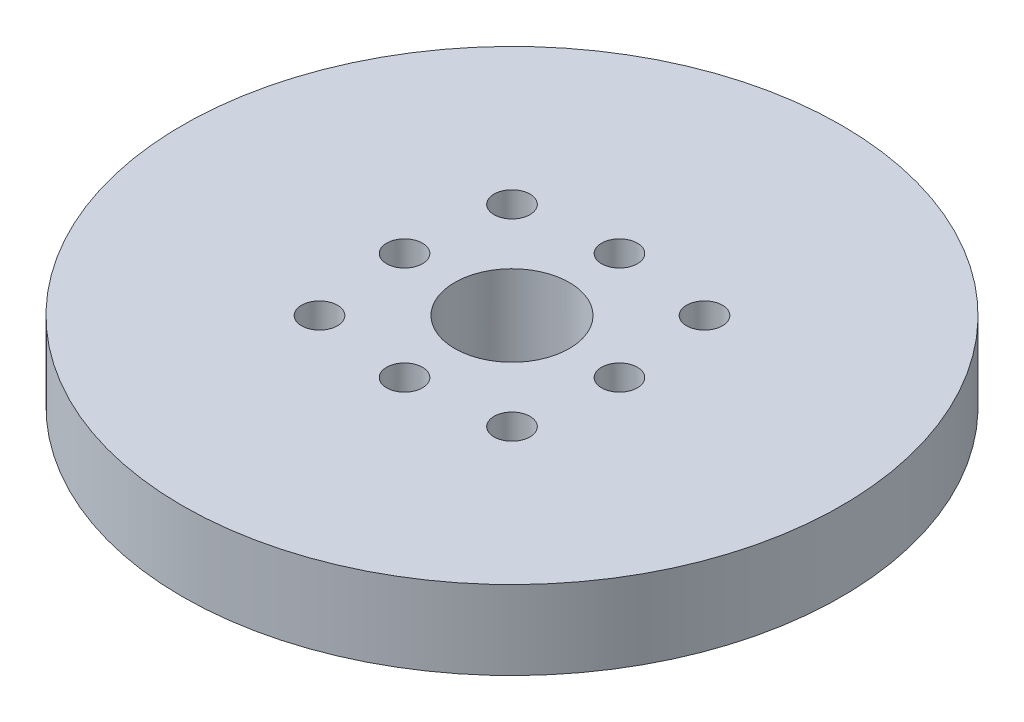
ISO-10303-21;
HEADER;
FILE_DESCRIPTION(('STEP AP214'),'2;1');
FILE_NAME('part.step','',(''),(''),'','','');
FILE_SCHEMA(('AUTOMOTIVE_DESIGN { 1 0 10303 214 1 1 1 1 }'));
ENDSEC;
DATA;
#1=APPLICATION_CONTEXT('core data for automotive mechanical design processes');
#2=APPLICATION_PROTOCOL_DEFINITION('international standard','automotive_design',2000,#1);
#3=PRODUCT_CONTEXT('',#1,'mechanical');
#4=PRODUCT('Part','Part','',(#3));
#5=PRODUCT_RELATED_PRODUCT_CATEGORY('part','',(#4));
#6=PRODUCT_DEFINITION_FORMATION('','',#4);
#7=PRODUCT_DEFINITION_CONTEXT('part definition',#1,'design');
#8=PRODUCT_DEFINITION('design','',#6,#7);
#9=PRODUCT_DEFINITION_SHAPE('','',#8);
#10=(LENGTH_UNIT() NAMED_UNIT(*) SI_UNIT(.MILLI.,.METRE.));
#11=(NAMED_UNIT(*) PLANE_ANGLE_UNIT() SI_UNIT($,.RADIAN.));
#12=(NAMED_UNIT(*) SI_UNIT($,.STERADIAN.) SOLID_ANGLE_UNIT());
#13=UNCERTAINTY_MEASURE_WITH_UNIT(LENGTH_MEASURE(1.E-05),#10,'distance_accuracy_value','');
#14=(GEOMETRIC_REPRESENTATION_CONTEXT(3) GLOBAL_UNCERTAINTY_ASSIGNED_CONTEXT((#13)) GLOBAL_UNIT_ASSIGNED_CONTEXT((#10,
#11,#12)) REPRESENTATION_CONTEXT('',''));
#15=CARTESIAN_POINT('',(0.,0.,0.));
#16=DIRECTION('',(0.,0.,1.));
#17=DIRECTION('',(1.,0.,0.));
#18=AXIS2_PLACEMENT_3D('',#15,#16,#17);
#19=CARTESIAN_POINT('',(0.,0.,0.));
#20=DIRECTION('',(0.,1.,0.));
#21=DIRECTION('',(0.,0.,1.));
#22=AXIS2_PLACEMENT_3D('',#19,#20,#21);
#23=PLANE('',#22);
#24=CARTESIAN_POINT('',(6.7175144212722,0.,-6.7175144212722));
#25=DIRECTION('',(0.,-1.,0.));
#26=DIRECTION('',(0.,0.,-1.));
#27=AXIS2_PLACEMENT_3D('',#24,#25,#26);
#28=CIRCLE('',#27,1.24999999999999);
#29=CARTESIAN_POINT('',(6.7175144212722,0.,-7.96751442127219));
#30=VERTEX_POINT('',#29);
#31=EDGE_CURVE('E75',#30,#30,#28,.T.);
#32=ORIENTED_EDGE('',*,*,#31,.F.);
#33=EDGE_LOOP('',(#32));
#34=FACE_BOUND('',#33,.T.);
#35=CARTESIAN_POINT('',(0.,0.,0.));
#36=DIRECTION('',(0.,1.,0.));
#37=DIRECTION('',(0.,0.,1.));
#38=AXIS2_PLACEMENT_3D('',#35,#36,#37);
#39=CIRCLE('',#38,23.);
#40=CARTESIAN_POINT('',(0.,0.,23.));
#41=VERTEX_POINT('',#40);
#42=EDGE_CURVE('E60',#41,#41,#39,.T.);
#43=ORIENTED_EDGE('',*,*,#42,.F.);
#44=EDGE_LOOP('',(#43));
#45=FACE_BOUND('',#44,.T.);
#46=CARTESIAN_POINT('',(-6.7175144212722,0.,6.7175144212722));
#47=DIRECTION('',(0.,-1.,0.));
#48=DIRECTION('',(0.,0.,-1.));
#49=AXIS2_PLACEMENT_3D('',#46,#47,#48);
#50=CIRCLE('',#49,1.24999999999999);
#51=CARTESIAN_POINT('',(-6.7175144212722,0.,5.46751442127221));
#52=VERTEX_POINT('',#51);
#53=EDGE_CURVE('E136',#52,#52,#50,.T.);
#54=ORIENTED_EDGE('',*,*,#53,.F.);
#55=EDGE_LOOP('',(#54));
#56=FACE_BOUND('',#55,.T.);
#57=CARTESIAN_POINT('',(-6.7175144212722,0.,-6.7175144212722));
#58=DIRECTION('',(0.,-1.,0.));
#59=DIRECTION('',(0.,0.,-1.));
#60=AXIS2_PLACEMENT_3D('',#57,#58,#59);
#61=CIRCLE('',#60,1.24999999999999);
#62=CARTESIAN_POINT('',(-6.7175144212722,0.,-7.96751442127219));
#63=VERTEX_POINT('',#62);
#64=EDGE_CURVE('E128',#63,#63,#61,.T.);
#65=ORIENTED_EDGE('',*,*,#64,.F.);
#66=EDGE_LOOP('',(#65));
#67=FACE_BOUND('',#66,.T.);
#68=CARTESIAN_POINT('',(6.7175144212722,0.,6.7175144212722));
#69=DIRECTION('',(0.,-1.,0.));
#70=DIRECTION('',(0.,0.,-1.));
#71=AXIS2_PLACEMENT_3D('',#68,#69,#70);
#72=CIRCLE('',#71,1.24999999999999);
#73=CARTESIAN_POINT('',(6.7175144212722,0.,5.46751442127221));
#74=VERTEX_POINT('',#73);
#75=EDGE_CURVE('E76',#74,#74,#72,.T.);
#76=ORIENTED_EDGE('',*,*,#75,.F.);
#77=EDGE_LOOP('',(#76));
#78=FACE_BOUND('',#77,.T.);
#79=CARTESIAN_POINT('',(0.,0.,7.5));
#80=DIRECTION('',(0.,-1.,0.));
#81=DIRECTION('',(0.,0.,-1.));
#82=AXIS2_PLACEMENT_3D('',#79,#80,#81);
#83=CIRCLE('',#82,1.24999999999999);
#84=CARTESIAN_POINT('',(0.,0.,6.25000000000001));
#85=VERTEX_POINT('',#84);
#86=EDGE_CURVE('E81',#85,#85,#83,.T.);
#87=ORIENTED_EDGE('',*,*,#86,.F.);
#88=EDGE_LOOP('',(#87));
#89=FACE_BOUND('',#88,.T.);
#90=CARTESIAN_POINT('',(-7.5,0.,0.));
#91=DIRECTION('',(0.,-1.,0.));
#92=DIRECTION('',(0.,0.,-1.));
#93=AXIS2_PLACEMENT_3D('',#90,#91,#92);
#94=CIRCLE('',#93,1.24999999999999);
#95=CARTESIAN_POINT('',(-7.5,0.,-1.24999999999999));
#96=VERTEX_POINT('',#95);
#97=EDGE_CURVE('E85',#96,#96,#94,.T.);
#98=ORIENTED_EDGE('',*,*,#97,.F.);
#99=EDGE_LOOP('',(#98));
#100=FACE_BOUND('',#99,.T.);
#101=CARTESIAN_POINT('',(0.,0.,-7.5));
#102=DIRECTION('',(0.,-1.,0.));
#103=DIRECTION('',(0.,0.,-1.));
#104=AXIS2_PLACEMENT_3D('',#101,#102,#103);
#105=CIRCLE('',#104,1.24999999999999);
#106=CARTESIAN_POINT('',(0.,0.,-8.74999999999999));
#107=VERTEX_POINT('',#106);
#108=EDGE_CURVE('E89',#107,#107,#105,.T.);
#109=ORIENTED_EDGE('',*,*,#108,.F.);
#110=EDGE_LOOP('',(#109));
#111=FACE_BOUND('',#110,.T.);
#112=CARTESIAN_POINT('',(7.5,0.,0.));
#113=DIRECTION('',(0.,-1.,0.));
#114=DIRECTION('',(0.,0.,-1.));
#115=AXIS2_PLACEMENT_3D('',#112,#113,#114);
#116=CIRCLE('',#115,1.24999999999999);
#117=CARTESIAN_POINT('',(7.5,0.,-1.24999999999999));
#118=VERTEX_POINT('',#117);
#119=EDGE_CURVE('E90',#118,#118,#116,.T.);
#120=ORIENTED_EDGE('',*,*,#119,.F.);
#121=EDGE_LOOP('',(#120));
#122=FACE_BOUND('',#121,.T.);
#123=CARTESIAN_POINT('',(0.,0.,0.));
#124=DIRECTION('',(0.,1.,0.));
#125=DIRECTION('',(0.,0.,1.));
#126=AXIS2_PLACEMENT_3D('',#123,#124,#125);
#127=CIRCLE('',#126,6.);
#128=CARTESIAN_POINT('',(0.,0.,6.));
#129=VERTEX_POINT('',#128);
#130=EDGE_CURVE('E10',#129,#129,#127,.F.);
#131=ORIENTED_EDGE('',*,*,#130,.F.);
#132=EDGE_LOOP('',(#131));
#133=FACE_BOUND('',#132,.T.);
#134=ADVANCED_FACE('F47',(#34,#45,#56,#67,#78,#89,#100,#111,#122,#133),#23,.F.);
#135=CARTESIAN_POINT('',(0.,5.5,0.));
#136=DIRECTION('',(0.,-1.,0.));
#137=DIRECTION('',(0.,0.,-1.));
#138=AXIS2_PLACEMENT_3D('',#135,#136,#137);
#139=CYLINDRICAL_SURFACE('',#138,23.);
#140=CARTESIAN_POINT('',(0.,5.5,0.));
#141=DIRECTION('',(0.,1.,0.));
#142=DIRECTION('',(0.,0.,1.));
#143=AXIS2_PLACEMENT_3D('',#140,#141,#142);
#144=CIRCLE('',#143,23.);
#145=CARTESIAN_POINT('',(0.,5.5,23.));
#146=VERTEX_POINT('',#145);
#147=EDGE_CURVE('E55',#146,#146,#144,.T.);
#148=ORIENTED_EDGE('',*,*,#147,.F.);
#149=EDGE_LOOP('',(#148));
#150=FACE_BOUND('',#149,.T.);
#151=ORIENTED_EDGE('',*,*,#42,.T.);
#152=EDGE_LOOP('',(#151));
#153=FACE_BOUND('',#152,.T.);
#154=ADVANCED_FACE('F49',(#150,#153),#139,.T.);
#155=CARTESIAN_POINT('',(0.,5.5,0.));
#156=DIRECTION('',(0.,1.,0.));
#157=DIRECTION('',(0.,0.,1.));
#158=AXIS2_PLACEMENT_3D('',#155,#156,#157);
#159=PLANE('',#158);
#160=CARTESIAN_POINT('',(7.5,5.5,0.));
#161=DIRECTION('',(0.,1.,0.));
#162=DIRECTION('',(0.,0.,1.));
#163=AXIS2_PLACEMENT_3D('',#160,#161,#162);
#164=CIRCLE('',#163,1.24999999999999);
#165=CARTESIAN_POINT('',(7.5,5.5,1.24999999999999));
#166=VERTEX_POINT('',#165);
#167=EDGE_CURVE('E86',#166,#166,#164,.T.);
#168=ORIENTED_EDGE('',*,*,#167,.F.);
#169=EDGE_LOOP('',(#168));
#170=FACE_BOUND('',#169,.T.);
#171=CARTESIAN_POINT('',(0.,5.5,-7.5));
#172=DIRECTION('',(0.,1.,0.));
#173=DIRECTION('',(0.,0.,1.));
#174=AXIS2_PLACEMENT_3D('',#171,#172,#173);
#175=CIRCLE('',#174,1.24999999999999);
#176=CARTESIAN_POINT('',(0.,5.5,-6.25000000000001));
#177=VERTEX_POINT('',#176);
#178=EDGE_CURVE('E96',#177,#177,#175,.T.);
#179=ORIENTED_EDGE('',*,*,#178,.F.);
#180=EDGE_LOOP('',(#179));
#181=FACE_BOUND('',#180,.T.);
#182=CARTESIAN_POINT('',(-7.5,5.5,0.));
#183=DIRECTION('',(0.,1.,0.));
#184=DIRECTION('',(0.,0.,1.));
#185=AXIS2_PLACEMENT_3D('',#182,#183,#184);
#186=CIRCLE('',#185,1.24999999999999);
#187=CARTESIAN_POINT('',(-7.5,5.5,1.24999999999999));
#188=VERTEX_POINT('',#187);
#189=EDGE_CURVE('E82',#188,#188,#186,.T.);
#190=ORIENTED_EDGE('',*,*,#189,.F.);
#191=EDGE_LOOP('',(#190));
#192=FACE_BOUND('',#191,.T.);
#193=CARTESIAN_POINT('',(0.,5.5,7.5));
#194=DIRECTION('',(0.,1.,0.));
#195=DIRECTION('',(0.,0.,1.));
#196=AXIS2_PLACEMENT_3D('',#193,#194,#195);
#197=CIRCLE('',#196,1.24999999999999);
#198=CARTESIAN_POINT('',(0.,5.5,8.74999999999999));
#199=VERTEX_POINT('',#198);
#200=EDGE_CURVE('E77',#199,#199,#197,.T.);
#201=ORIENTED_EDGE('',*,*,#200,.F.);
#202=EDGE_LOOP('',(#201));
#203=FACE_BOUND('',#202,.T.);
#204=CARTESIAN_POINT('',(6.7175144212722,5.5,6.7175144212722));
#205=DIRECTION('',(0.,1.,0.));
#206=DIRECTION('',(0.,0.,1.));
#207=AXIS2_PLACEMENT_3D('',#204,#205,#206);
#208=CIRCLE('',#207,1.24999999999999);
#209=CARTESIAN_POINT('',(6.7175144212722,5.5,7.96751442127219));
#210=VERTEX_POINT('',#209);
#211=EDGE_CURVE('E71',#210,#210,#208,.T.);
#212=ORIENTED_EDGE('',*,*,#211,.F.);
#213=EDGE_LOOP('',(#212));
#214=FACE_BOUND('',#213,.T.);
#215=CARTESIAN_POINT('',(6.7175144212722,5.5,-6.7175144212722));
#216=DIRECTION('',(0.,1.,0.));
#217=DIRECTION('',(0.,0.,1.));
#218=AXIS2_PLACEMENT_3D('',#215,#216,#217);
#219=CIRCLE('',#218,1.24999999999999);
#220=CARTESIAN_POINT('',(6.7175144212722,5.5,-5.46751442127221));
#221=VERTEX_POINT('',#220);
#222=EDGE_CURVE('E124',#221,#221,#219,.T.);
#223=ORIENTED_EDGE('',*,*,#222,.F.);
#224=EDGE_LOOP('',(#223));
#225=FACE_BOUND('',#224,.T.);
#226=CARTESIAN_POINT('',(-6.7175144212722,5.5,-6.7175144212722));
#227=DIRECTION('',(0.,1.,0.));
#228=DIRECTION('',(0.,0.,1.));
#229=AXIS2_PLACEMENT_3D('',#226,#227,#228);
#230=CIRCLE('',#229,1.24999999999999);
#231=CARTESIAN_POINT('',(-6.7175144212722,5.5,-5.46751442127221));
#232=VERTEX_POINT('',#231);
#233=EDGE_CURVE('E132',#232,#232,#230,.T.);
#234=ORIENTED_EDGE('',*,*,#233,.F.);
#235=EDGE_LOOP('',(#234));
#236=FACE_BOUND('',#235,.T.);
#237=CARTESIAN_POINT('',(-6.7175144212722,5.5,6.7175144212722));
#238=DIRECTION('',(0.,1.,0.));
#239=DIRECTION('',(0.,0.,1.));
#240=AXIS2_PLACEMENT_3D('',#237,#238,#239);
#241=CIRCLE('',#240,1.24999999999999);
#242=CARTESIAN_POINT('',(-6.7175144212722,5.5,7.96751442127219));
#243=VERTEX_POINT('',#242);
#244=EDGE_CURVE('E139',#243,#243,#241,.T.);
#245=ORIENTED_EDGE('',*,*,#244,.F.);
#246=EDGE_LOOP('',(#245));
#247=FACE_BOUND('',#246,.T.);
#248=CARTESIAN_POINT('',(0.,5.5,0.));
#249=DIRECTION('',(0.,1.,0.));
#250=DIRECTION('',(0.,0.,1.));
#251=AXIS2_PLACEMENT_3D('',#248,#249,#250);
#252=CIRCLE('',#251,4.);
#253=CARTESIAN_POINT('',(0.,5.5,4.));
#254=VERTEX_POINT('',#253);
#255=EDGE_CURVE('E66',#254,#254,#252,.T.);
#256=ORIENTED_EDGE('',*,*,#255,.F.);
#257=EDGE_LOOP('',(#256));
#258=FACE_BOUND('',#257,.T.);
#259=ORIENTED_EDGE('',*,*,#147,.T.);
#260=EDGE_LOOP('',(#259));
#261=FACE_BOUND('',#260,.T.);
#262=ADVANCED_FACE('F151',(#170,#181,#192,#203,#214,#225,#236,#247,#258,#261),#159,.T.);
#263=CARTESIAN_POINT('',(0.,-11.3137084989848,0.));
#264=DIRECTION('',(0.,1.,0.));
#265=DIRECTION('',(0.,0.,1.));
#266=AXIS2_PLACEMENT_3D('',#263,#264,#265);
#267=CYLINDRICAL_SURFACE('',#266,4.);
#268=ORIENTED_EDGE('',*,*,#255,.T.);
#269=EDGE_LOOP('',(#268));
#270=FACE_BOUND('',#269,.T.);
#271=CARTESIAN_POINT('',(0.,-1.,0.));
#272=DIRECTION('',(0.,-1.,0.));
#273=DIRECTION('',(0.,0.,-1.));
#274=AXIS2_PLACEMENT_3D('',#271,#272,#273);
#275=CIRCLE('',#274,4.);
#276=CARTESIAN_POINT('',(0.,-1.,-4.));
#277=VERTEX_POINT('',#276);
#278=EDGE_CURVE('E105',#277,#277,#275,.T.);
#279=ORIENTED_EDGE('',*,*,#278,.T.);
#280=EDGE_LOOP('',(#279));
#281=FACE_BOUND('',#280,.T.);
#282=ADVANCED_FACE('F148',(#270,#281),#267,.F.);
#283=CARTESIAN_POINT('',(-6.7175144212722,0.,6.7175144212722));
#284=DIRECTION('',(0.,-1.,0.));
#285=DIRECTION('',(0.,0.,-1.));
#286=AXIS2_PLACEMENT_3D('',#283,#284,#285);
#287=CYLINDRICAL_SURFACE('',#286,1.24999999999999);
#288=ORIENTED_EDGE('',*,*,#244,.T.);
#289=EDGE_LOOP('',(#288));
#290=FACE_BOUND('',#289,.T.);
#291=ORIENTED_EDGE('',*,*,#53,.T.);
#292=EDGE_LOOP('',(#291));
#293=FACE_BOUND('',#292,.T.);
#294=ADVANCED_FACE('F159',(#290,#293),#287,.F.);
#295=CARTESIAN_POINT('',(-6.7175144212722,0.,-6.7175144212722));
#296=DIRECTION('',(0.,-1.,0.));
#297=DIRECTION('',(0.,0.,-1.));
#298=AXIS2_PLACEMENT_3D('',#295,#296,#297);
#299=CYLINDRICAL_SURFACE('',#298,1.24999999999999);
#300=ORIENTED_EDGE('',*,*,#233,.T.);
#301=EDGE_LOOP('',(#300));
#302=FACE_BOUND('',#301,.T.);
#303=ORIENTED_EDGE('',*,*,#64,.T.);
#304=EDGE_LOOP('',(#303));
#305=FACE_BOUND('',#304,.T.);
#306=ADVANCED_FACE('F212',(#302,#305),#299,.F.);
#307=CARTESIAN_POINT('',(6.7175144212722,0.,-6.7175144212722));
#308=DIRECTION('',(0.,-1.,0.));
#309=DIRECTION('',(0.,0.,-1.));
#310=AXIS2_PLACEMENT_3D('',#307,#308,#309);
#311=CYLINDRICAL_SURFACE('',#310,1.24999999999999);
#312=ORIENTED_EDGE('',*,*,#222,.T.);
#313=EDGE_LOOP('',(#312));
#314=FACE_BOUND('',#313,.T.);
#315=ORIENTED_EDGE('',*,*,#31,.T.);
#316=EDGE_LOOP('',(#315));
#317=FACE_BOUND('',#316,.T.);
#318=ADVANCED_FACE('F208',(#314,#317),#311,.F.);
#319=CARTESIAN_POINT('',(6.7175144212722,0.,6.7175144212722));
#320=DIRECTION('',(0.,-1.,0.));
#321=DIRECTION('',(0.,0.,-1.));
#322=AXIS2_PLACEMENT_3D('',#319,#320,#321);
#323=CYLINDRICAL_SURFACE('',#322,1.24999999999999);
#324=ORIENTED_EDGE('',*,*,#211,.T.);
#325=EDGE_LOOP('',(#324));
#326=FACE_BOUND('',#325,.T.);
#327=ORIENTED_EDGE('',*,*,#75,.T.);
#328=EDGE_LOOP('',(#327));
#329=FACE_BOUND('',#328,.T.);
#330=ADVANCED_FACE('F204',(#326,#329),#323,.F.);
#331=CARTESIAN_POINT('',(0.,0.,7.5));
#332=DIRECTION('',(0.,-1.,0.));
#333=DIRECTION('',(0.,0.,-1.));
#334=AXIS2_PLACEMENT_3D('',#331,#332,#333);
#335=CYLINDRICAL_SURFACE('',#334,1.24999999999999);
#336=ORIENTED_EDGE('',*,*,#200,.T.);
#337=EDGE_LOOP('',(#336));
#338=FACE_BOUND('',#337,.T.);
#339=ORIENTED_EDGE('',*,*,#86,.T.);
#340=EDGE_LOOP('',(#339));
#341=FACE_BOUND('',#340,.T.);
#342=ADVANCED_FACE('F197',(#338,#341),#335,.F.);
#343=CARTESIAN_POINT('',(-7.5,0.,0.));
#344=DIRECTION('',(0.,-1.,0.));
#345=DIRECTION('',(0.,0.,-1.));
#346=AXIS2_PLACEMENT_3D('',#343,#344,#345);
#347=CYLINDRICAL_SURFACE('',#346,1.24999999999999);
#348=ORIENTED_EDGE('',*,*,#189,.T.);
#349=EDGE_LOOP('',(#348));
#350=FACE_BOUND('',#349,.T.);
#351=ORIENTED_EDGE('',*,*,#97,.T.);
#352=EDGE_LOOP('',(#351));
#353=FACE_BOUND('',#352,.T.);
#354=ADVANCED_FACE('F188',(#350,#353),#347,.F.);
#355=CARTESIAN_POINT('',(0.,0.,-7.5));
#356=DIRECTION('',(0.,-1.,0.));
#357=DIRECTION('',(0.,0.,-1.));
#358=AXIS2_PLACEMENT_3D('',#355,#356,#357);
#359=CYLINDRICAL_SURFACE('',#358,1.24999999999999);
#360=ORIENTED_EDGE('',*,*,#178,.T.);
#361=EDGE_LOOP('',(#360));
#362=FACE_BOUND('',#361,.T.);
#363=ORIENTED_EDGE('',*,*,#108,.T.);
#364=EDGE_LOOP('',(#363));
#365=FACE_BOUND('',#364,.T.);
#366=ADVANCED_FACE('F185',(#362,#365),#359,.F.);
#367=CARTESIAN_POINT('',(7.5,0.,0.));
#368=DIRECTION('',(0.,-1.,0.));
#369=DIRECTION('',(0.,0.,-1.));
#370=AXIS2_PLACEMENT_3D('',#367,#368,#369);
#371=CYLINDRICAL_SURFACE('',#370,1.24999999999999);
#372=ORIENTED_EDGE('',*,*,#167,.T.);
#373=EDGE_LOOP('',(#372));
#374=FACE_BOUND('',#373,.T.);
#375=ORIENTED_EDGE('',*,*,#119,.T.);
#376=EDGE_LOOP('',(#375));
#377=FACE_BOUND('',#376,.T.);
#378=ADVANCED_FACE('F187',(#374,#377),#371,.F.);
#379=CARTESIAN_POINT('',(0.,-1.,0.));
#380=DIRECTION('',(0.,-1.,0.));
#381=DIRECTION('',(0.,0.,-1.));
#382=AXIS2_PLACEMENT_3D('',#379,#380,#381);
#383=PLANE('',#382);
#384=CARTESIAN_POINT('',(0.,-1.,0.));
#385=DIRECTION('',(0.,-1.,0.));
#386=DIRECTION('',(0.,0.,-1.));
#387=AXIS2_PLACEMENT_3D('',#384,#385,#386);
#388=CIRCLE('',#387,6.);
#389=CARTESIAN_POINT('',(0.,-1.,-6.));
#390=VERTEX_POINT('',#389);
#391=EDGE_CURVE('E99',#390,#390,#388,.T.);
#392=ORIENTED_EDGE('',*,*,#391,.T.);
#393=EDGE_LOOP('',(#392));
#394=FACE_BOUND('',#393,.T.);
#395=ORIENTED_EDGE('',*,*,#278,.F.);
#396=EDGE_LOOP('',(#395));
#397=FACE_BOUND('',#396,.T.);
#398=ADVANCED_FACE('F195',(#394,#397),#383,.T.);
#399=CARTESIAN_POINT('',(0.,-1.,0.));
#400=DIRECTION('',(0.,1.,0.));
#401=DIRECTION('',(0.,0.,1.));
#402=AXIS2_PLACEMENT_3D('',#399,#400,#401);
#403=CYLINDRICAL_SURFACE('',#402,6.);
#404=ORIENTED_EDGE('',*,*,#391,.F.);
#405=EDGE_LOOP('',(#404));
#406=FACE_BOUND('',#405,.T.);
#407=ORIENTED_EDGE('',*,*,#130,.T.);
#408=EDGE_LOOP('',(#407));
#409=FACE_BOUND('',#408,.T.);
#410=ADVANCED_FACE('F258',(#406,#409),#403,.T.);
#411=CLOSED_SHELL('',(#134,#154,#262,#282,#294,#306,#318,#330,#342,#354,#366,#378,#398,#410));
#412=MANIFOLD_SOLID_BREP('B2',#411);
#413=ADVANCED_BREP_SHAPE_REPRESENTATION('',(#18,#412),#14);
#414=SHAPE_DEFINITION_REPRESENTATION(#9,#413);
ENDSEC;
END-ISO-10303-21;
